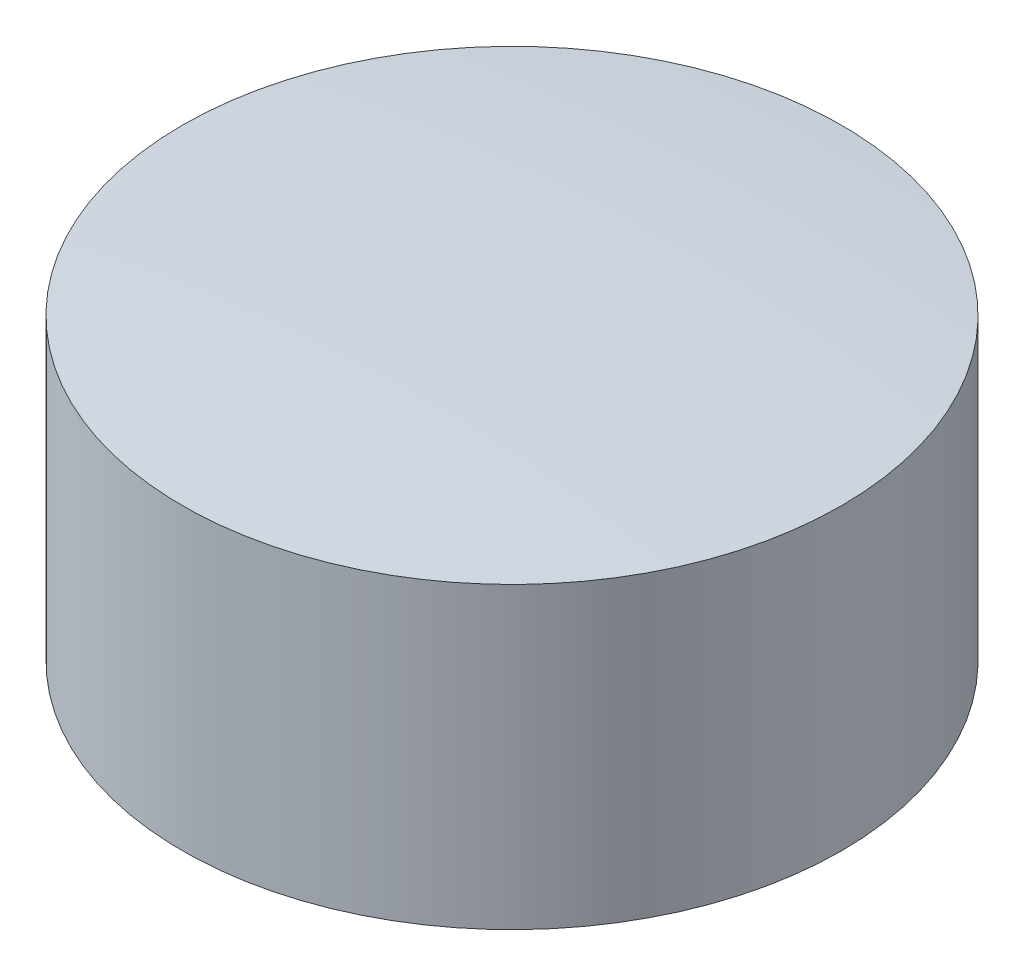
ISO-10303-21;
HEADER;
FILE_DESCRIPTION(('STEP AP214'),'2;1');
FILE_NAME('part.step','',(''),(''),'','','');
FILE_SCHEMA(('AUTOMOTIVE_DESIGN { 1 0 10303 214 1 1 1 1 }'));
ENDSEC;
DATA;
#1=APPLICATION_CONTEXT('core data for automotive mechanical design processes');
#2=APPLICATION_PROTOCOL_DEFINITION('international standard','automotive_design',2000,#1);
#3=PRODUCT_CONTEXT('',#1,'mechanical');
#4=PRODUCT('Part','Part','',(#3));
#5=PRODUCT_RELATED_PRODUCT_CATEGORY('part','',(#4));
#6=PRODUCT_DEFINITION_FORMATION('','',#4);
#7=PRODUCT_DEFINITION_CONTEXT('part definition',#1,'design');
#8=PRODUCT_DEFINITION('design','',#6,#7);
#9=PRODUCT_DEFINITION_SHAPE('','',#8);
#10=(LENGTH_UNIT() NAMED_UNIT(*) SI_UNIT(.MILLI.,.METRE.));
#11=(NAMED_UNIT(*) PLANE_ANGLE_UNIT() SI_UNIT($,.RADIAN.));
#12=(NAMED_UNIT(*) SI_UNIT($,.STERADIAN.) SOLID_ANGLE_UNIT());
#13=UNCERTAINTY_MEASURE_WITH_UNIT(LENGTH_MEASURE(1.E-05),#10,'distance_accuracy_value','');
#14=(GEOMETRIC_REPRESENTATION_CONTEXT(3) GLOBAL_UNCERTAINTY_ASSIGNED_CONTEXT((#13)) GLOBAL_UNIT_ASSIGNED_CONTEXT((#10,
#11,#12)) REPRESENTATION_CONTEXT('',''));
#15=CARTESIAN_POINT('',(0.,0.,0.));
#16=DIRECTION('',(0.,0.,1.));
#17=DIRECTION('',(1.,0.,0.));
#18=AXIS2_PLACEMENT_3D('',#15,#16,#17);
#19=CARTESIAN_POINT('',(0.,6006.79363292537,-843.244434569781));
#20=DIRECTION('',(0.,0.,-1.));
#21=DIRECTION('',(0.,-1.,0.));
#22=AXIS2_PLACEMENT_3D('',#19,#20,#21);
#23=SPHERICAL_SURFACE('',#22,128.682995164334);
#24=CARTESIAN_POINT('',(7.53948194816651E-13,5894.03143516183,-843.244434569781));
#25=DIRECTION('',(0.,-1.,0.));
#26=DIRECTION('',(1.,0.,0.));
#27=AXIS2_PLACEMENT_3D('',#24,#25,#26);
#28=CIRCLE('',#27,62.);
#29=CARTESIAN_POINT('',(62.0000000000008,5894.03143516183,-843.244434569781));
#30=VERTEX_POINT('',#29);
#31=EDGE_CURVE('E18',#30,#30,#28,.F.);
#32=ORIENTED_EDGE('',*,*,#31,.F.);
#33=EDGE_LOOP('',(#32));
#34=FACE_BOUND('',#33,.T.);
#35=ADVANCED_FACE('F14',(#34),#23,.T.);
#36=CARTESIAN_POINT('',(-1.13686837721616E-13,5274.69566130929,-843.244434569781));
#37=DIRECTION('',(0.,0.,-1.));
#38=DIRECTION('',(0.,1.,0.));
#39=AXIS2_PLACEMENT_3D('',#36,#37,#38);
#40=SPHERICAL_SURFACE('',#39,678.414976451746);
#41=CARTESIAN_POINT('',(0.,5950.2716231922,-843.244434569781));
#42=DIRECTION('',(0.,-1.,0.));
#43=DIRECTION('',(1.,0.,0.));
#44=AXIS2_PLACEMENT_3D('',#41,#42,#43);
#45=CIRCLE('',#44,62.);
#46=CARTESIAN_POINT('',(61.9999999999999,5950.2716231922,-843.244434569781));
#47=VERTEX_POINT('',#46);
#48=EDGE_CURVE('E10',#47,#47,#45,.T.);
#49=ORIENTED_EDGE('',*,*,#48,.F.);
#50=EDGE_LOOP('',(#49));
#51=FACE_BOUND('',#50,.T.);
#52=ADVANCED_FACE('F29',(#51),#40,.T.);
#53=CARTESIAN_POINT('',(0.,5950.27162319221,-843.244434569781));
#54=DIRECTION('',(0.,-1.,0.));
#55=DIRECTION('',(1.,0.,0.));
#56=AXIS2_PLACEMENT_3D('',#53,#54,#55);
#57=CYLINDRICAL_SURFACE('',#56,62.);
#58=ORIENTED_EDGE('',*,*,#48,.T.);
#59=EDGE_LOOP('',(#58));
#60=FACE_BOUND('',#59,.T.);
#61=ORIENTED_EDGE('',*,*,#31,.T.);
#62=EDGE_LOOP('',(#61));
#63=FACE_BOUND('',#62,.T.);
#64=ADVANCED_FACE('F16',(#60,#63),#57,.T.);
#65=CLOSED_SHELL('',(#35,#52,#64));
#66=MANIFOLD_SOLID_BREP('B1',#65);
#67=ADVANCED_BREP_SHAPE_REPRESENTATION('',(#18,#66),#14);
#68=SHAPE_DEFINITION_REPRESENTATION(#9,#67);
ENDSEC;
END-ISO-10303-21;
